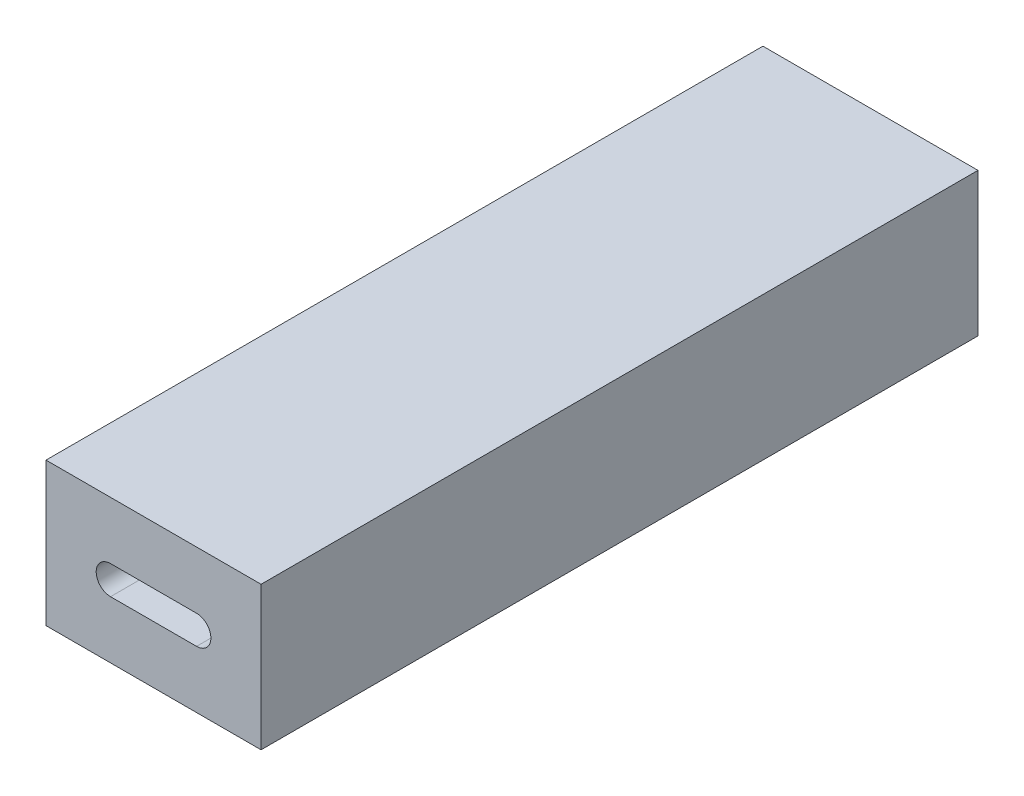
ISO-10303-21;
HEADER;
FILE_DESCRIPTION(('STEP AP214'),'2;1');
FILE_NAME('part.step','',(''),(''),'','','');
FILE_SCHEMA(('AUTOMOTIVE_DESIGN { 1 0 10303 214 1 1 1 1 }'));
ENDSEC;
DATA;
#1=APPLICATION_CONTEXT('core data for automotive mechanical design processes');
#2=APPLICATION_PROTOCOL_DEFINITION('international standard','automotive_design',2000,#1);
#3=PRODUCT_CONTEXT('',#1,'mechanical');
#4=PRODUCT('Part','Part','',(#3));
#5=PRODUCT_RELATED_PRODUCT_CATEGORY('part','',(#4));
#6=PRODUCT_DEFINITION_FORMATION('','',#4);
#7=PRODUCT_DEFINITION_CONTEXT('part definition',#1,'design');
#8=PRODUCT_DEFINITION('design','',#6,#7);
#9=PRODUCT_DEFINITION_SHAPE('','',#8);
#10=(LENGTH_UNIT() NAMED_UNIT(*) SI_UNIT(.MILLI.,.METRE.));
#11=(NAMED_UNIT(*) PLANE_ANGLE_UNIT() SI_UNIT($,.RADIAN.));
#12=(NAMED_UNIT(*) SI_UNIT($,.STERADIAN.) SOLID_ANGLE_UNIT());
#13=UNCERTAINTY_MEASURE_WITH_UNIT(LENGTH_MEASURE(1.E-05),#10,'distance_accuracy_value','');
#14=(GEOMETRIC_REPRESENTATION_CONTEXT(3) GLOBAL_UNCERTAINTY_ASSIGNED_CONTEXT((#13)) GLOBAL_UNIT_ASSIGNED_CONTEXT((#10,
#11,#12)) REPRESENTATION_CONTEXT('',''));
#15=CARTESIAN_POINT('',(0.,0.,0.));
#16=DIRECTION('',(0.,0.,1.));
#17=DIRECTION('',(1.,0.,0.));
#18=AXIS2_PLACEMENT_3D('',#15,#16,#17);
#19=CARTESIAN_POINT('',(3.,0.,25.));
#20=DIRECTION('',(0.,0.,1.));
#21=DIRECTION('',(1.,0.,0.));
#22=AXIS2_PLACEMENT_3D('',#19,#20,#21);
#23=PLANE('',#22);
#24=DIRECTION('',(-1.,0.,0.));
#25=VECTOR('',#24,1.);
#26=CARTESIAN_POINT('',(-3.,1.,25.));
#27=LINE('',#26,#25);
#28=CARTESIAN_POINT('',(3.,1.,25.));
#29=VERTEX_POINT('',#28);
#30=CARTESIAN_POINT('',(1.73205080756888,1.,25.));
#31=VERTEX_POINT('',#30);
#32=EDGE_CURVE('E143',#29,#31,#27,.T.);
#33=ORIENTED_EDGE('',*,*,#32,.T.);
#34=CARTESIAN_POINT('',(0.,0.,25.));
#35=DIRECTION('',(0.,0.,-1.));
#36=DIRECTION('',(-1.,0.,0.));
#37=AXIS2_PLACEMENT_3D('',#34,#35,#36);
#38=CIRCLE('',#37,2.);
#39=CARTESIAN_POINT('',(1.73205080756888,-1.,25.));
#40=VERTEX_POINT('',#39);
#41=EDGE_CURVE('E121',#31,#40,#38,.T.);
#42=ORIENTED_EDGE('',*,*,#41,.T.);
#43=DIRECTION('',(1.,0.,0.));
#44=VECTOR('',#43,1.);
#45=CARTESIAN_POINT('',(-3.,-1.,25.));
#46=LINE('',#45,#44);
#47=CARTESIAN_POINT('',(3.,-1.,25.));
#48=VERTEX_POINT('',#47);
#49=EDGE_CURVE('E155',#40,#48,#46,.T.);
#50=ORIENTED_EDGE('',*,*,#49,.T.);
#51=CARTESIAN_POINT('',(3.,0.,25.));
#52=DIRECTION('',(0.,0.,1.));
#53=DIRECTION('',(1.,0.,0.));
#54=AXIS2_PLACEMENT_3D('',#51,#52,#53);
#55=CIRCLE('',#54,1.);
#56=EDGE_CURVE('E150',#48,#29,#55,.T.);
#57=ORIENTED_EDGE('',*,*,#56,.T.);
#58=EDGE_LOOP('',(#33,#42,#50,#57));
#59=FACE_BOUND('',#58,.T.);
#60=ADVANCED_FACE('F44',(#59),#23,.T.);
#61=CARTESIAN_POINT('',(-7.5,5.,50.));
#62=DIRECTION('',(1.,0.,0.));
#63=DIRECTION('',(0.,0.,-1.));
#64=AXIS2_PLACEMENT_3D('',#61,#62,#63);
#65=PLANE('',#64);
#66=DIRECTION('',(0.,-1.,0.));
#67=VECTOR('',#66,1.);
#68=CARTESIAN_POINT('',(-7.5,5.,0.));
#69=LINE('',#68,#67);
#70=CARTESIAN_POINT('',(-7.5,5.,0.));
#71=VERTEX_POINT('',#70);
#72=CARTESIAN_POINT('',(-7.5,-5.,0.));
#73=VERTEX_POINT('',#72);
#74=EDGE_CURVE('E197',#71,#73,#69,.T.);
#75=ORIENTED_EDGE('',*,*,#74,.T.);
#76=DIRECTION('',(0.,0.,-1.));
#77=VECTOR('',#76,1.);
#78=CARTESIAN_POINT('',(-7.5,-5.,50.));
#79=LINE('',#78,#77);
#80=CARTESIAN_POINT('',(-7.5,-5.,50.));
#81=VERTEX_POINT('',#80);
#82=EDGE_CURVE('E11',#81,#73,#79,.T.);
#83=ORIENTED_EDGE('',*,*,#82,.F.);
#84=DIRECTION('',(0.,-1.,0.));
#85=VECTOR('',#84,1.);
#86=CARTESIAN_POINT('',(-7.5,5.,50.));
#87=LINE('',#86,#85);
#88=CARTESIAN_POINT('',(-7.5,5.,50.));
#89=VERTEX_POINT('',#88);
#90=EDGE_CURVE('E218',#89,#81,#87,.T.);
#91=ORIENTED_EDGE('',*,*,#90,.F.);
#92=DIRECTION('',(0.,0.,-1.));
#93=VECTOR('',#92,1.);
#94=CARTESIAN_POINT('',(-7.5,5.,50.));
#95=LINE('',#94,#93);
#96=EDGE_CURVE('E232',#89,#71,#95,.T.);
#97=ORIENTED_EDGE('',*,*,#96,.T.);
#98=EDGE_LOOP('',(#75,#83,#91,#97));
#99=FACE_BOUND('',#98,.T.);
#100=ADVANCED_FACE('F46',(#99),#65,.F.);
#101=CARTESIAN_POINT('',(-7.5,-5.,50.));
#102=DIRECTION('',(0.,1.,0.));
#103=DIRECTION('',(0.,0.,1.));
#104=AXIS2_PLACEMENT_3D('',#101,#102,#103);
#105=PLANE('',#104);
#106=DIRECTION('',(1.,0.,0.));
#107=VECTOR('',#106,1.);
#108=CARTESIAN_POINT('',(-7.5,-5.,0.));
#109=LINE('',#108,#107);
#110=CARTESIAN_POINT('',(7.5,-5.,0.));
#111=VERTEX_POINT('',#110);
#112=EDGE_CURVE('E236',#73,#111,#109,.T.);
#113=ORIENTED_EDGE('',*,*,#112,.T.);
#114=DIRECTION('',(0.,0.,-1.));
#115=VECTOR('',#114,1.);
#116=CARTESIAN_POINT('',(7.5,-5.,50.));
#117=LINE('',#116,#115);
#118=CARTESIAN_POINT('',(7.5,-5.,50.));
#119=VERTEX_POINT('',#118);
#120=EDGE_CURVE('E53',#119,#111,#117,.T.);
#121=ORIENTED_EDGE('',*,*,#120,.F.);
#122=DIRECTION('',(1.,0.,0.));
#123=VECTOR('',#122,1.);
#124=CARTESIAN_POINT('',(-7.5,-5.,50.));
#125=LINE('',#124,#123);
#126=EDGE_CURVE('E222',#81,#119,#125,.T.);
#127=ORIENTED_EDGE('',*,*,#126,.F.);
#128=ORIENTED_EDGE('',*,*,#82,.T.);
#129=EDGE_LOOP('',(#113,#121,#127,#128));
#130=FACE_BOUND('',#129,.T.);
#131=ADVANCED_FACE('F270',(#130),#105,.F.);
#132=CARTESIAN_POINT('',(7.5,5.,50.));
#133=DIRECTION('',(-1.,0.,0.));
#134=DIRECTION('',(0.,-1.,0.));
#135=AXIS2_PLACEMENT_3D('',#132,#133,#134);
#136=PLANE('',#135);
#137=DIRECTION('',(0.,1.,0.));
#138=VECTOR('',#137,1.);
#139=CARTESIAN_POINT('',(7.5,5.,0.));
#140=LINE('',#139,#138);
#141=CARTESIAN_POINT('',(7.5,5.,0.));
#142=VERTEX_POINT('',#141);
#143=EDGE_CURVE('E239',#111,#142,#140,.T.);
#144=ORIENTED_EDGE('',*,*,#143,.T.);
#145=DIRECTION('',(0.,0.,-1.));
#146=VECTOR('',#145,1.);
#147=CARTESIAN_POINT('',(7.5,5.,50.));
#148=LINE('',#147,#146);
#149=CARTESIAN_POINT('',(7.5,5.,50.));
#150=VERTEX_POINT('',#149);
#151=EDGE_CURVE('E247',#150,#142,#148,.T.);
#152=ORIENTED_EDGE('',*,*,#151,.F.);
#153=DIRECTION('',(0.,1.,0.));
#154=VECTOR('',#153,1.);
#155=CARTESIAN_POINT('',(7.5,5.,50.));
#156=LINE('',#155,#154);
#157=EDGE_CURVE('E226',#119,#150,#156,.T.);
#158=ORIENTED_EDGE('',*,*,#157,.F.);
#159=ORIENTED_EDGE('',*,*,#120,.T.);
#160=EDGE_LOOP('',(#144,#152,#158,#159));
#161=FACE_BOUND('',#160,.T.);
#162=ADVANCED_FACE('F256',(#161),#136,.F.);
#163=CARTESIAN_POINT('',(-7.5,5.,50.));
#164=DIRECTION('',(0.,-1.,0.));
#165=DIRECTION('',(0.,0.,-1.));
#166=AXIS2_PLACEMENT_3D('',#163,#164,#165);
#167=PLANE('',#166);
#168=DIRECTION('',(-1.,0.,0.));
#169=VECTOR('',#168,1.);
#170=CARTESIAN_POINT('',(-7.5,5.,0.));
#171=LINE('',#170,#169);
#172=EDGE_CURVE('E223',#142,#71,#171,.T.);
#173=ORIENTED_EDGE('',*,*,#172,.T.);
#174=ORIENTED_EDGE('',*,*,#96,.F.);
#175=DIRECTION('',(-1.,0.,0.));
#176=VECTOR('',#175,1.);
#177=CARTESIAN_POINT('',(-7.5,5.,50.));
#178=LINE('',#177,#176);
#179=EDGE_CURVE('E229',#150,#89,#178,.T.);
#180=ORIENTED_EDGE('',*,*,#179,.F.);
#181=ORIENTED_EDGE('',*,*,#151,.T.);
#182=EDGE_LOOP('',(#173,#174,#180,#181));
#183=FACE_BOUND('',#182,.T.);
#184=ADVANCED_FACE('F265',(#183),#167,.F.);
#185=CARTESIAN_POINT('',(0.,0.,50.));
#186=DIRECTION('',(0.,0.,1.));
#187=DIRECTION('',(1.,0.,0.));
#188=AXIS2_PLACEMENT_3D('',#185,#186,#187);
#189=PLANE('',#188);
#190=CARTESIAN_POINT('',(3.,0.,50.));
#191=DIRECTION('',(0.,0.,1.));
#192=DIRECTION('',(1.,0.,0.));
#193=AXIS2_PLACEMENT_3D('',#190,#191,#192);
#194=CIRCLE('',#193,1.);
#195=CARTESIAN_POINT('',(3.,-1.,50.));
#196=VERTEX_POINT('',#195);
#197=CARTESIAN_POINT('',(3.,1.,50.));
#198=VERTEX_POINT('',#197);
#199=EDGE_CURVE('E68',#196,#198,#194,.T.);
#200=ORIENTED_EDGE('',*,*,#199,.F.);
#201=DIRECTION('',(1.,0.,0.));
#202=VECTOR('',#201,1.);
#203=CARTESIAN_POINT('',(-3.,-1.,50.));
#204=LINE('',#203,#202);
#205=CARTESIAN_POINT('',(-3.,-1.,50.));
#206=VERTEX_POINT('',#205);
#207=EDGE_CURVE('E161',#206,#196,#204,.T.);
#208=ORIENTED_EDGE('',*,*,#207,.F.);
#209=CARTESIAN_POINT('',(-3.,0.,50.));
#210=DIRECTION('',(0.,0.,1.));
#211=DIRECTION('',(1.,0.,0.));
#212=AXIS2_PLACEMENT_3D('',#209,#210,#211);
#213=CIRCLE('',#212,1.);
#214=CARTESIAN_POINT('',(-3.,1.,50.));
#215=VERTEX_POINT('',#214);
#216=EDGE_CURVE('E164',#215,#206,#213,.T.);
#217=ORIENTED_EDGE('',*,*,#216,.F.);
#218=DIRECTION('',(-1.,0.,0.));
#219=VECTOR('',#218,1.);
#220=CARTESIAN_POINT('',(-3.,1.,50.));
#221=LINE('',#220,#219);
#222=EDGE_CURVE('E202',#198,#215,#221,.T.);
#223=ORIENTED_EDGE('',*,*,#222,.F.);
#224=EDGE_LOOP('',(#200,#208,#217,#223));
#225=FACE_BOUND('',#224,.T.);
#226=ORIENTED_EDGE('',*,*,#90,.T.);
#227=ORIENTED_EDGE('',*,*,#126,.T.);
#228=ORIENTED_EDGE('',*,*,#157,.T.);
#229=ORIENTED_EDGE('',*,*,#179,.T.);
#230=EDGE_LOOP('',(#226,#227,#228,#229));
#231=FACE_BOUND('',#230,.T.);
#232=ADVANCED_FACE('F205',(#225,#231),#189,.T.);
#233=CARTESIAN_POINT('',(0.,0.,0.));
#234=DIRECTION('',(0.,0.,1.));
#235=DIRECTION('',(1.,0.,0.));
#236=AXIS2_PLACEMENT_3D('',#233,#234,#235);
#237=PLANE('',#236);
#238=CARTESIAN_POINT('',(0.,0.,0.));
#239=DIRECTION('',(0.,0.,-1.));
#240=DIRECTION('',(-1.,0.,0.));
#241=AXIS2_PLACEMENT_3D('',#238,#239,#240);
#242=CIRCLE('',#241,2.);
#243=CARTESIAN_POINT('',(-2.,0.,0.));
#244=VERTEX_POINT('',#243);
#245=EDGE_CURVE('E167',#244,#244,#242,.T.);
#246=ORIENTED_EDGE('',*,*,#245,.F.);
#247=EDGE_LOOP('',(#246));
#248=FACE_BOUND('',#247,.T.);
#249=ORIENTED_EDGE('',*,*,#74,.F.);
#250=ORIENTED_EDGE('',*,*,#172,.F.);
#251=ORIENTED_EDGE('',*,*,#143,.F.);
#252=ORIENTED_EDGE('',*,*,#112,.F.);
#253=EDGE_LOOP('',(#249,#250,#251,#252));
#254=FACE_BOUND('',#253,.T.);
#255=ADVANCED_FACE('F262',(#248,#254),#237,.F.);
#256=CARTESIAN_POINT('',(3.,0.,25.));
#257=DIRECTION('',(0.,0.,1.));
#258=DIRECTION('',(1.,0.,0.));
#259=AXIS2_PLACEMENT_3D('',#256,#257,#258);
#260=CYLINDRICAL_SURFACE('',#259,1.);
#261=ORIENTED_EDGE('',*,*,#199,.T.);
#262=DIRECTION('',(0.,0.,1.));
#263=VECTOR('',#262,1.);
#264=CARTESIAN_POINT('',(3.,1.,25.));
#265=LINE('',#264,#263);
#266=EDGE_CURVE('E188',#29,#198,#265,.T.);
#267=ORIENTED_EDGE('',*,*,#266,.F.);
#268=ORIENTED_EDGE('',*,*,#56,.F.);
#269=DIRECTION('',(0.,0.,1.));
#270=VECTOR('',#269,1.);
#271=CARTESIAN_POINT('',(3.,-1.,25.));
#272=LINE('',#271,#270);
#273=EDGE_CURVE('E194',#48,#196,#272,.T.);
#274=ORIENTED_EDGE('',*,*,#273,.T.);
#275=EDGE_LOOP('',(#261,#267,#268,#274));
#276=FACE_BOUND('',#275,.T.);
#277=ADVANCED_FACE('F200',(#276),#260,.F.);
#278=CARTESIAN_POINT('',(-3.,-1.,25.));
#279=DIRECTION('',(0.,-1.,0.));
#280=DIRECTION('',(1.,0.,0.));
#281=AXIS2_PLACEMENT_3D('',#278,#279,#280);
#282=PLANE('',#281);
#283=ORIENTED_EDGE('',*,*,#207,.T.);
#284=ORIENTED_EDGE('',*,*,#273,.F.);
#285=ORIENTED_EDGE('',*,*,#49,.F.);
#286=CARTESIAN_POINT('',(-1.73205080756888,-1.,25.));
#287=VERTEX_POINT('',#286);
#288=EDGE_CURVE('E177',#287,#40,#46,.T.);
#289=ORIENTED_EDGE('',*,*,#288,.F.);
#290=CARTESIAN_POINT('',(-3.,-1.,25.));
#291=VERTEX_POINT('',#290);
#292=EDGE_CURVE('E181',#291,#287,#46,.T.);
#293=ORIENTED_EDGE('',*,*,#292,.F.);
#294=DIRECTION('',(0.,0.,1.));
#295=VECTOR('',#294,1.);
#296=CARTESIAN_POINT('',(-3.,-1.,25.));
#297=LINE('',#296,#295);
#298=EDGE_CURVE('E198',#291,#206,#297,.T.);
#299=ORIENTED_EDGE('',*,*,#298,.T.);
#300=EDGE_LOOP('',(#283,#284,#285,#289,#293,#299));
#301=FACE_BOUND('',#300,.T.);
#302=ADVANCED_FACE('F180',(#301),#282,.F.);
#303=CARTESIAN_POINT('',(-3.,0.,25.));
#304=DIRECTION('',(0.,0.,1.));
#305=DIRECTION('',(1.,0.,0.));
#306=AXIS2_PLACEMENT_3D('',#303,#304,#305);
#307=CYLINDRICAL_SURFACE('',#306,1.);
#308=ORIENTED_EDGE('',*,*,#216,.T.);
#309=ORIENTED_EDGE('',*,*,#298,.F.);
#310=CARTESIAN_POINT('',(-3.,0.,25.));
#311=DIRECTION('',(0.,0.,1.));
#312=DIRECTION('',(1.,0.,0.));
#313=AXIS2_PLACEMENT_3D('',#310,#311,#312);
#314=CIRCLE('',#313,1.);
#315=CARTESIAN_POINT('',(-3.,1.,25.));
#316=VERTEX_POINT('',#315);
#317=EDGE_CURVE('E152',#316,#291,#314,.T.);
#318=ORIENTED_EDGE('',*,*,#317,.F.);
#319=DIRECTION('',(0.,0.,1.));
#320=VECTOR('',#319,1.);
#321=CARTESIAN_POINT('',(-3.,1.,25.));
#322=LINE('',#321,#320);
#323=EDGE_CURVE('E190',#316,#215,#322,.T.);
#324=ORIENTED_EDGE('',*,*,#323,.T.);
#325=EDGE_LOOP('',(#308,#309,#318,#324));
#326=FACE_BOUND('',#325,.T.);
#327=ADVANCED_FACE('F289',(#326),#307,.F.);
#328=CARTESIAN_POINT('',(-3.,1.,25.));
#329=DIRECTION('',(0.,1.,0.));
#330=DIRECTION('',(0.,0.,1.));
#331=AXIS2_PLACEMENT_3D('',#328,#329,#330);
#332=PLANE('',#331);
#333=ORIENTED_EDGE('',*,*,#222,.T.);
#334=ORIENTED_EDGE('',*,*,#323,.F.);
#335=CARTESIAN_POINT('',(-1.73205080756888,1.,25.));
#336=VERTEX_POINT('',#335);
#337=EDGE_CURVE('E146',#336,#316,#27,.T.);
#338=ORIENTED_EDGE('',*,*,#337,.F.);
#339=EDGE_CURVE('E134',#31,#336,#27,.T.);
#340=ORIENTED_EDGE('',*,*,#339,.F.);
#341=ORIENTED_EDGE('',*,*,#32,.F.);
#342=ORIENTED_EDGE('',*,*,#266,.T.);
#343=EDGE_LOOP('',(#333,#334,#338,#340,#341,#342));
#344=FACE_BOUND('',#343,.T.);
#345=ADVANCED_FACE('F142',(#344),#332,.F.);
#346=ORIENTED_EDGE('',*,*,#292,.T.);
#347=EDGE_CURVE('E137',#287,#336,#38,.T.);
#348=ORIENTED_EDGE('',*,*,#347,.T.);
#349=ORIENTED_EDGE('',*,*,#337,.T.);
#350=ORIENTED_EDGE('',*,*,#317,.T.);
#351=EDGE_LOOP('',(#346,#348,#349,#350));
#352=FACE_BOUND('',#351,.T.);
#353=ADVANCED_FACE('F185',(#352),#23,.T.);
#354=CARTESIAN_POINT('',(0.,0.,25.));
#355=DIRECTION('',(0.,0.,-1.));
#356=DIRECTION('',(-1.,0.,0.));
#357=AXIS2_PLACEMENT_3D('',#354,#355,#356);
#358=PLANE('',#357);
#359=ORIENTED_EDGE('',*,*,#339,.T.);
#360=EDGE_CURVE('E60',#336,#31,#38,.T.);
#361=ORIENTED_EDGE('',*,*,#360,.T.);
#362=EDGE_LOOP('',(#359,#361));
#363=FACE_BOUND('',#362,.T.);
#364=ADVANCED_FACE('F133',(#363),#358,.T.);
#365=ORIENTED_EDGE('',*,*,#288,.T.);
#366=EDGE_CURVE('E125',#40,#287,#38,.T.);
#367=ORIENTED_EDGE('',*,*,#366,.T.);
#368=EDGE_LOOP('',(#365,#367));
#369=FACE_BOUND('',#368,.T.);
#370=ADVANCED_FACE('F176',(#369),#358,.T.);
#371=CARTESIAN_POINT('',(0.,0.,25.));
#372=DIRECTION('',(0.,0.,-1.));
#373=DIRECTION('',(-1.,0.,0.));
#374=AXIS2_PLACEMENT_3D('',#371,#372,#373);
#375=CYLINDRICAL_SURFACE('',#374,2.);
#376=ORIENTED_EDGE('',*,*,#360,.F.);
#377=ORIENTED_EDGE('',*,*,#347,.F.);
#378=ORIENTED_EDGE('',*,*,#366,.F.);
#379=ORIENTED_EDGE('',*,*,#41,.F.);
#380=EDGE_LOOP('',(#376,#377,#378,#379));
#381=FACE_BOUND('',#380,.T.);
#382=ORIENTED_EDGE('',*,*,#245,.T.);
#383=EDGE_LOOP('',(#382));
#384=FACE_BOUND('',#383,.T.);
#385=ADVANCED_FACE('F122',(#381,#384),#375,.F.);
#386=CLOSED_SHELL('',(#60,#100,#131,#162,#184,#232,#255,#277,#302,#327,#345,#353,#364,#370,#385));
#387=MANIFOLD_SOLID_BREP('B2',#386);
#388=ADVANCED_BREP_SHAPE_REPRESENTATION('',(#18,#387),#14);
#389=SHAPE_DEFINITION_REPRESENTATION(#9,#388);
ENDSEC;
END-ISO-10303-21;
